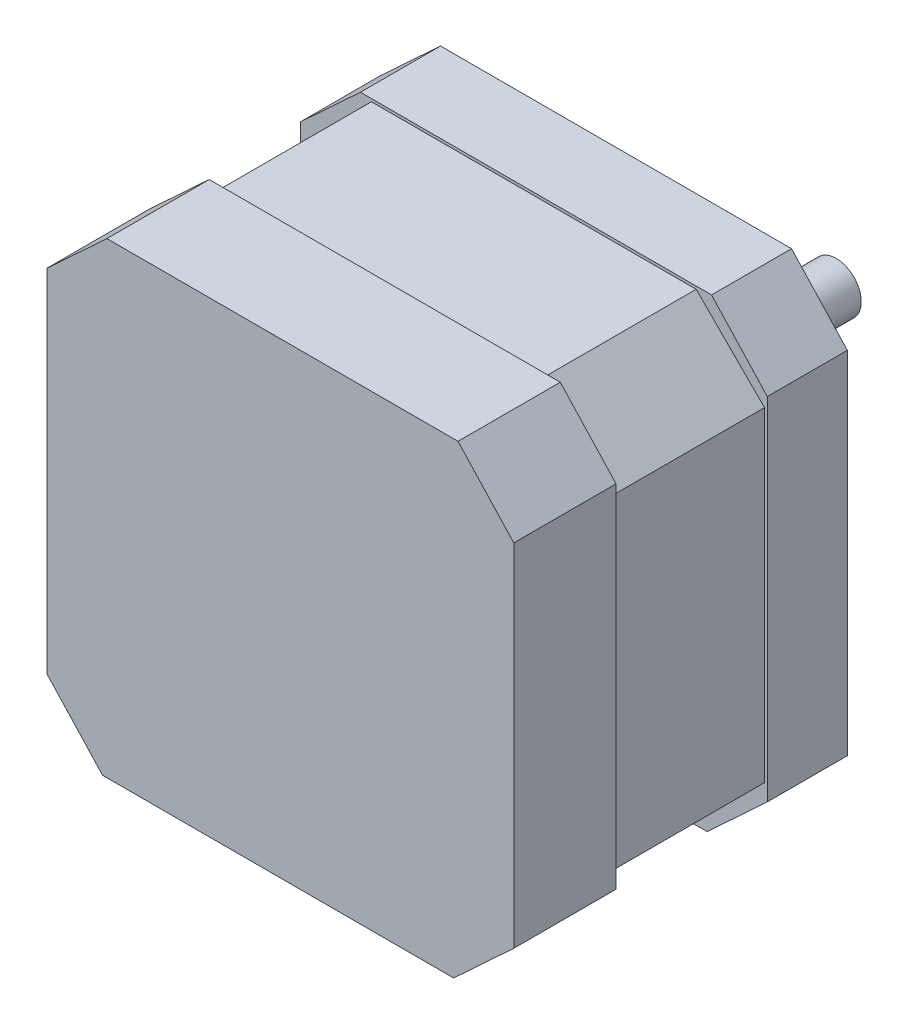
ISO-10303-21;
HEADER;
FILE_DESCRIPTION(('STEP AP214'),'2;1');
FILE_NAME('part.step','',(''),(''),'','','');
FILE_SCHEMA(('AUTOMOTIVE_DESIGN { 1 0 10303 214 1 1 1 1 }'));
ENDSEC;
DATA;
#1=APPLICATION_CONTEXT('core data for automotive mechanical design processes');
#2=APPLICATION_PROTOCOL_DEFINITION('international standard','automotive_design',2000,#1);
#3=PRODUCT_CONTEXT('',#1,'mechanical');
#4=PRODUCT('Part','Part','',(#3));
#5=PRODUCT_RELATED_PRODUCT_CATEGORY('part','',(#4));
#6=PRODUCT_DEFINITION_FORMATION('','',#4);
#7=PRODUCT_DEFINITION_CONTEXT('part definition',#1,'design');
#8=PRODUCT_DEFINITION('design','',#6,#7);
#9=PRODUCT_DEFINITION_SHAPE('','',#8);
#10=(LENGTH_UNIT() NAMED_UNIT(*) SI_UNIT(.MILLI.,.METRE.));
#11=(NAMED_UNIT(*) PLANE_ANGLE_UNIT() SI_UNIT($,.RADIAN.));
#12=(NAMED_UNIT(*) SI_UNIT($,.STERADIAN.) SOLID_ANGLE_UNIT());
#13=UNCERTAINTY_MEASURE_WITH_UNIT(LENGTH_MEASURE(1.E-05),#10,'distance_accuracy_value','');
#14=(GEOMETRIC_REPRESENTATION_CONTEXT(3) GLOBAL_UNCERTAINTY_ASSIGNED_CONTEXT((#13)) GLOBAL_UNIT_ASSIGNED_CONTEXT((#10,
#11,#12)) REPRESENTATION_CONTEXT('',''));
#15=CARTESIAN_POINT('',(0.,0.,0.));
#16=DIRECTION('',(0.,0.,1.));
#17=DIRECTION('',(1.,0.,0.));
#18=AXIS2_PLACEMENT_3D('',#15,#16,#17);
#19=CARTESIAN_POINT('',(21.,0.,30.));
#20=DIRECTION('',(1.,0.,0.));
#21=DIRECTION('',(0.,1.,0.));
#22=AXIS2_PLACEMENT_3D('',#19,#20,#21);
#23=PLANE('',#22);
#24=DIRECTION('',(0.,0.,-1.));
#25=VECTOR('',#24,1.);
#26=CARTESIAN_POINT('',(21.,-15.9841759962391,30.));
#27=LINE('',#26,#25);
#28=CARTESIAN_POINT('',(21.,-15.9841759962391,30.));
#29=VERTEX_POINT('',#28);
#30=CARTESIAN_POINT('',(21.,-15.9841759962391,20.8));
#31=VERTEX_POINT('',#30);
#32=EDGE_CURVE('E380',#29,#31,#27,.T.);
#33=ORIENTED_EDGE('',*,*,#32,.T.);
#34=DIRECTION('',(0.,1.,0.));
#35=VECTOR('',#34,1.);
#36=CARTESIAN_POINT('',(21.,0.,20.8));
#37=LINE('',#36,#35);
#38=CARTESIAN_POINT('',(21.,15.5921718725903,20.8));
#39=VERTEX_POINT('',#38);
#40=EDGE_CURVE('E107',#31,#39,#37,.T.);
#41=ORIENTED_EDGE('',*,*,#40,.T.);
#42=DIRECTION('',(0.,0.,-1.));
#43=VECTOR('',#42,1.);
#44=CARTESIAN_POINT('',(21.,15.5921718725903,30.));
#45=LINE('',#44,#43);
#46=CARTESIAN_POINT('',(21.,15.5921718725903,30.));
#47=VERTEX_POINT('',#46);
#48=EDGE_CURVE('E408',#47,#39,#45,.T.);
#49=ORIENTED_EDGE('',*,*,#48,.F.);
#50=DIRECTION('',(0.,-1.,0.));
#51=VECTOR('',#50,1.);
#52=CARTESIAN_POINT('',(21.,0.,30.));
#53=LINE('',#52,#51);
#54=EDGE_CURVE('E336',#47,#29,#53,.T.);
#55=ORIENTED_EDGE('',*,*,#54,.T.);
#56=EDGE_LOOP('',(#33,#41,#49,#55));
#57=FACE_BOUND('',#56,.T.);
#58=ADVANCED_FACE('F85',(#57),#23,.T.);
#59=CARTESIAN_POINT('',(19.0627004123154,17.6808781736177,30.));
#60=DIRECTION('',(-0.733180785089054,-0.680033775908373,0.));
#61=DIRECTION('',(0.680033775908373,-0.733180785089054,0.));
#62=AXIS2_PLACEMENT_3D('',#59,#60,#61);
#63=PLANE('',#62);
#64=DIRECTION('',(0.680033775908373,-0.733180785089054,0.));
#65=VECTOR('',#64,1.);
#66=CARTESIAN_POINT('',(19.0627004123154,17.6808781736177,20.8));
#67=LINE('',#66,#65);
#68=CARTESIAN_POINT('',(15.9841759962391,21.,20.8));
#69=VERTEX_POINT('',#68);
#70=EDGE_CURVE('E332',#69,#39,#67,.T.);
#71=ORIENTED_EDGE('',*,*,#70,.F.);
#72=DIRECTION('',(0.,0.,-1.));
#73=VECTOR('',#72,1.);
#74=CARTESIAN_POINT('',(15.9841759962391,21.,30.));
#75=LINE('',#74,#73);
#76=CARTESIAN_POINT('',(15.9841759962391,21.,30.));
#77=VERTEX_POINT('',#76);
#78=EDGE_CURVE('E404',#77,#69,#75,.T.);
#79=ORIENTED_EDGE('',*,*,#78,.F.);
#80=DIRECTION('',(-0.680033775908373,0.733180785089054,0.));
#81=VECTOR('',#80,1.);
#82=CARTESIAN_POINT('',(19.0627004123154,17.6808781736177,30.));
#83=LINE('',#82,#81);
#84=EDGE_CURVE('E339',#47,#77,#83,.T.);
#85=ORIENTED_EDGE('',*,*,#84,.F.);
#86=ORIENTED_EDGE('',*,*,#48,.T.);
#87=EDGE_LOOP('',(#71,#79,#85,#86));
#88=FACE_BOUND('',#87,.T.);
#89=ADVANCED_FACE('F480',(#88),#63,.F.);
#90=CARTESIAN_POINT('',(0.,21.,30.));
#91=DIRECTION('',(0.,1.,0.));
#92=DIRECTION('',(0.,0.,1.));
#93=AXIS2_PLACEMENT_3D('',#90,#91,#92);
#94=PLANE('',#93);
#95=ORIENTED_EDGE('',*,*,#78,.T.);
#96=DIRECTION('',(-1.,0.,0.));
#97=VECTOR('',#96,1.);
#98=CARTESIAN_POINT('',(0.,21.,20.8));
#99=LINE('',#98,#97);
#100=CARTESIAN_POINT('',(-15.5921718725903,21.,20.8));
#101=VERTEX_POINT('',#100);
#102=EDGE_CURVE('E329',#69,#101,#99,.T.);
#103=ORIENTED_EDGE('',*,*,#102,.T.);
#104=DIRECTION('',(0.,0.,-1.));
#105=VECTOR('',#104,1.);
#106=CARTESIAN_POINT('',(-15.5921718725903,21.,30.));
#107=LINE('',#106,#105);
#108=CARTESIAN_POINT('',(-15.5921718725903,21.,30.));
#109=VERTEX_POINT('',#108);
#110=EDGE_CURVE('E400',#109,#101,#107,.T.);
#111=ORIENTED_EDGE('',*,*,#110,.F.);
#112=DIRECTION('',(1.,0.,0.));
#113=VECTOR('',#112,1.);
#114=CARTESIAN_POINT('',(0.,21.,30.));
#115=LINE('',#114,#113);
#116=EDGE_CURVE('E342',#109,#77,#115,.T.);
#117=ORIENTED_EDGE('',*,*,#116,.T.);
#118=EDGE_LOOP('',(#95,#103,#111,#117));
#119=FACE_BOUND('',#118,.T.);
#120=ADVANCED_FACE('F486',(#119),#94,.T.);
#121=CARTESIAN_POINT('',(-17.6808781736177,19.0627004123154,30.));
#122=DIRECTION('',(-0.680033775908373,0.733180785089054,0.));
#123=DIRECTION('',(-0.733180785089054,-0.680033775908373,0.));
#124=AXIS2_PLACEMENT_3D('',#121,#122,#123);
#125=PLANE('',#124);
#126=ORIENTED_EDGE('',*,*,#110,.T.);
#127=DIRECTION('',(-0.733180785089054,-0.680033775908373,0.));
#128=VECTOR('',#127,1.);
#129=CARTESIAN_POINT('',(-17.6808781736177,19.0627004123154,20.8));
#130=LINE('',#129,#128);
#131=CARTESIAN_POINT('',(-21.,15.9841759962391,20.8));
#132=VERTEX_POINT('',#131);
#133=EDGE_CURVE('E326',#101,#132,#130,.T.);
#134=ORIENTED_EDGE('',*,*,#133,.T.);
#135=DIRECTION('',(0.,0.,-1.));
#136=VECTOR('',#135,1.);
#137=CARTESIAN_POINT('',(-21.,15.9841759962391,30.));
#138=LINE('',#137,#136);
#139=CARTESIAN_POINT('',(-21.,15.9841759962391,30.));
#140=VERTEX_POINT('',#139);
#141=EDGE_CURVE('E396',#140,#132,#138,.T.);
#142=ORIENTED_EDGE('',*,*,#141,.F.);
#143=DIRECTION('',(0.733180785089054,0.680033775908373,0.));
#144=VECTOR('',#143,1.);
#145=CARTESIAN_POINT('',(-17.6808781736177,19.0627004123154,30.));
#146=LINE('',#145,#144);
#147=EDGE_CURVE('E345',#140,#109,#146,.T.);
#148=ORIENTED_EDGE('',*,*,#147,.T.);
#149=EDGE_LOOP('',(#126,#134,#142,#148));
#150=FACE_BOUND('',#149,.T.);
#151=ADVANCED_FACE('F572',(#150),#125,.T.);
#152=CARTESIAN_POINT('',(-21.,0.,30.));
#153=DIRECTION('',(1.,0.,0.));
#154=DIRECTION('',(0.,1.,0.));
#155=AXIS2_PLACEMENT_3D('',#152,#153,#154);
#156=PLANE('',#155);
#157=DIRECTION('',(0.,1.,0.));
#158=VECTOR('',#157,1.);
#159=CARTESIAN_POINT('',(-21.,0.,20.8));
#160=LINE('',#159,#158);
#161=CARTESIAN_POINT('',(-21.,-15.5921718725903,20.8));
#162=VERTEX_POINT('',#161);
#163=EDGE_CURVE('E324',#162,#132,#160,.T.);
#164=ORIENTED_EDGE('',*,*,#163,.F.);
#165=DIRECTION('',(0.,0.,-1.));
#166=VECTOR('',#165,1.);
#167=CARTESIAN_POINT('',(-21.,-15.5921718725903,30.));
#168=LINE('',#167,#166);
#169=CARTESIAN_POINT('',(-21.,-15.5921718725903,30.));
#170=VERTEX_POINT('',#169);
#171=EDGE_CURVE('E392',#170,#162,#168,.T.);
#172=ORIENTED_EDGE('',*,*,#171,.F.);
#173=DIRECTION('',(0.,-1.,0.));
#174=VECTOR('',#173,1.);
#175=CARTESIAN_POINT('',(-21.,0.,30.));
#176=LINE('',#175,#174);
#177=EDGE_CURVE('E348',#140,#170,#176,.T.);
#178=ORIENTED_EDGE('',*,*,#177,.F.);
#179=ORIENTED_EDGE('',*,*,#141,.T.);
#180=EDGE_LOOP('',(#164,#172,#178,#179));
#181=FACE_BOUND('',#180,.T.);
#182=ADVANCED_FACE('F569',(#181),#156,.F.);
#183=CARTESIAN_POINT('',(-19.0627004123154,-17.6808781736177,30.));
#184=DIRECTION('',(-0.733180785089054,-0.680033775908373,0.));
#185=DIRECTION('',(0.680033775908373,-0.733180785089054,0.));
#186=AXIS2_PLACEMENT_3D('',#183,#184,#185);
#187=PLANE('',#186);
#188=ORIENTED_EDGE('',*,*,#171,.T.);
#189=DIRECTION('',(0.680033775908373,-0.733180785089054,0.));
#190=VECTOR('',#189,1.);
#191=CARTESIAN_POINT('',(-19.0627004123154,-17.6808781736177,20.8));
#192=LINE('',#191,#190);
#193=CARTESIAN_POINT('',(-15.9841759962391,-21.,20.8));
#194=VERTEX_POINT('',#193);
#195=EDGE_CURVE('E321',#162,#194,#192,.T.);
#196=ORIENTED_EDGE('',*,*,#195,.T.);
#197=DIRECTION('',(0.,0.,-1.));
#198=VECTOR('',#197,1.);
#199=CARTESIAN_POINT('',(-15.9841759962391,-21.,30.));
#200=LINE('',#199,#198);
#201=CARTESIAN_POINT('',(-15.9841759962391,-21.,30.));
#202=VERTEX_POINT('',#201);
#203=EDGE_CURVE('E388',#202,#194,#200,.T.);
#204=ORIENTED_EDGE('',*,*,#203,.F.);
#205=DIRECTION('',(-0.680033775908373,0.733180785089054,0.));
#206=VECTOR('',#205,1.);
#207=CARTESIAN_POINT('',(-19.0627004123154,-17.6808781736177,30.));
#208=LINE('',#207,#206);
#209=EDGE_CURVE('E350',#202,#170,#208,.T.);
#210=ORIENTED_EDGE('',*,*,#209,.T.);
#211=EDGE_LOOP('',(#188,#196,#204,#210));
#212=FACE_BOUND('',#211,.T.);
#213=ADVANCED_FACE('F552',(#212),#187,.T.);
#214=CARTESIAN_POINT('',(0.,-21.,30.));
#215=DIRECTION('',(0.,1.,0.));
#216=DIRECTION('',(0.,0.,1.));
#217=AXIS2_PLACEMENT_3D('',#214,#215,#216);
#218=PLANE('',#217);
#219=DIRECTION('',(-1.,0.,0.));
#220=VECTOR('',#219,1.);
#221=CARTESIAN_POINT('',(0.,-21.,20.8));
#222=LINE('',#221,#220);
#223=CARTESIAN_POINT('',(15.5921718725902,-21.,20.8));
#224=VERTEX_POINT('',#223);
#225=EDGE_CURVE('E319',#224,#194,#222,.T.);
#226=ORIENTED_EDGE('',*,*,#225,.F.);
#227=DIRECTION('',(0.,0.,-1.));
#228=VECTOR('',#227,1.);
#229=CARTESIAN_POINT('',(15.5921718725902,-21.,30.));
#230=LINE('',#229,#228);
#231=CARTESIAN_POINT('',(15.5921718725902,-21.,30.));
#232=VERTEX_POINT('',#231);
#233=EDGE_CURVE('E384',#232,#224,#230,.T.);
#234=ORIENTED_EDGE('',*,*,#233,.F.);
#235=DIRECTION('',(1.,0.,0.));
#236=VECTOR('',#235,1.);
#237=CARTESIAN_POINT('',(0.,-21.,30.));
#238=LINE('',#237,#236);
#239=EDGE_CURVE('E353',#202,#232,#238,.T.);
#240=ORIENTED_EDGE('',*,*,#239,.F.);
#241=ORIENTED_EDGE('',*,*,#203,.T.);
#242=EDGE_LOOP('',(#226,#234,#240,#241));
#243=FACE_BOUND('',#242,.T.);
#244=ADVANCED_FACE('F540',(#243),#218,.F.);
#245=CARTESIAN_POINT('',(17.6808781736177,-19.0627004123154,30.));
#246=DIRECTION('',(-0.680033775908373,0.733180785089054,0.));
#247=DIRECTION('',(-0.733180785089054,-0.680033775908373,0.));
#248=AXIS2_PLACEMENT_3D('',#245,#246,#247);
#249=PLANE('',#248);
#250=DIRECTION('',(-0.733180785089054,-0.680033775908373,0.));
#251=VECTOR('',#250,1.);
#252=CARTESIAN_POINT('',(17.6808781736177,-19.0627004123154,20.8));
#253=LINE('',#252,#251);
#254=EDGE_CURVE('E92',#31,#224,#253,.T.);
#255=ORIENTED_EDGE('',*,*,#254,.F.);
#256=ORIENTED_EDGE('',*,*,#32,.F.);
#257=DIRECTION('',(0.733180785089054,0.680033775908373,0.));
#258=VECTOR('',#257,1.);
#259=CARTESIAN_POINT('',(17.6808781736177,-19.0627004123154,30.));
#260=LINE('',#259,#258);
#261=EDGE_CURVE('E355',#232,#29,#260,.T.);
#262=ORIENTED_EDGE('',*,*,#261,.F.);
#263=ORIENTED_EDGE('',*,*,#233,.T.);
#264=EDGE_LOOP('',(#255,#256,#262,#263));
#265=FACE_BOUND('',#264,.T.);
#266=ADVANCED_FACE('F534',(#265),#249,.F.);
#267=CARTESIAN_POINT('',(0.,0.,30.));
#268=DIRECTION('',(0.,0.,1.));
#269=DIRECTION('',(1.,0.,0.));
#270=AXIS2_PLACEMENT_3D('',#267,#268,#269);
#271=PLANE('',#270);
#272=ORIENTED_EDGE('',*,*,#54,.F.);
#273=ORIENTED_EDGE('',*,*,#84,.T.);
#274=ORIENTED_EDGE('',*,*,#116,.F.);
#275=ORIENTED_EDGE('',*,*,#147,.F.);
#276=ORIENTED_EDGE('',*,*,#177,.T.);
#277=ORIENTED_EDGE('',*,*,#209,.F.);
#278=ORIENTED_EDGE('',*,*,#239,.T.);
#279=ORIENTED_EDGE('',*,*,#261,.T.);
#280=EDGE_LOOP('',(#272,#273,#274,#275,#276,#277,#278,#279));
#281=FACE_BOUND('',#280,.T.);
#282=ADVANCED_FACE('F544',(#281),#271,.T.);
#283=CARTESIAN_POINT('',(0.,0.,20.8));
#284=DIRECTION('',(0.,0.,-1.));
#285=DIRECTION('',(-1.,0.,0.));
#286=AXIS2_PLACEMENT_3D('',#283,#284,#285);
#287=PLANE('',#286);
#288=ORIENTED_EDGE('',*,*,#254,.T.);
#289=ORIENTED_EDGE('',*,*,#225,.T.);
#290=ORIENTED_EDGE('',*,*,#195,.F.);
#291=ORIENTED_EDGE('',*,*,#163,.T.);
#292=ORIENTED_EDGE('',*,*,#133,.F.);
#293=ORIENTED_EDGE('',*,*,#102,.F.);
#294=ORIENTED_EDGE('',*,*,#70,.T.);
#295=ORIENTED_EDGE('',*,*,#40,.F.);
#296=EDGE_LOOP('',(#288,#289,#290,#291,#292,#293,#294,#295));
#297=FACE_BOUND('',#296,.T.);
#298=DIRECTION('',(-0.707106781186548,0.707106781186547,0.));
#299=VECTOR('',#298,1.);
#300=CARTESIAN_POINT('',(17.6776695296637,17.6776695296637,20.8));
#301=LINE('',#300,#299);
#302=CARTESIAN_POINT('',(20.75,14.6053390593274,20.8));
#303=VERTEX_POINT('',#302);
#304=CARTESIAN_POINT('',(14.6053390593274,20.75,20.8));
#305=VERTEX_POINT('',#304);
#306=EDGE_CURVE('E249',#303,#305,#301,.T.);
#307=ORIENTED_EDGE('',*,*,#306,.T.);
#308=DIRECTION('',(1.,0.,0.));
#309=VECTOR('',#308,1.);
#310=CARTESIAN_POINT('',(0.,20.75,20.8));
#311=LINE('',#310,#309);
#312=CARTESIAN_POINT('',(-14.6053390593274,20.75,20.8));
#313=VERTEX_POINT('',#312);
#314=EDGE_CURVE('E263',#313,#305,#311,.T.);
#315=ORIENTED_EDGE('',*,*,#314,.F.);
#316=DIRECTION('',(0.707106781186547,0.707106781186548,0.));
#317=VECTOR('',#316,1.);
#318=CARTESIAN_POINT('',(-17.6776695296637,17.6776695296637,20.8));
#319=LINE('',#318,#317);
#320=CARTESIAN_POINT('',(-20.75,14.6053390593274,20.8));
#321=VERTEX_POINT('',#320);
#322=EDGE_CURVE('E271',#321,#313,#319,.T.);
#323=ORIENTED_EDGE('',*,*,#322,.F.);
#324=DIRECTION('',(0.,1.,0.));
#325=VECTOR('',#324,1.);
#326=CARTESIAN_POINT('',(-20.75,0.,20.8));
#327=LINE('',#326,#325);
#328=CARTESIAN_POINT('',(-20.75,-14.6053390593274,20.8));
#329=VERTEX_POINT('',#328);
#330=EDGE_CURVE('E273',#329,#321,#327,.T.);
#331=ORIENTED_EDGE('',*,*,#330,.F.);
#332=DIRECTION('',(-0.707106781186547,0.707106781186548,0.));
#333=VECTOR('',#332,1.);
#334=CARTESIAN_POINT('',(-17.6776695296637,-17.6776695296637,20.8));
#335=LINE('',#334,#333);
#336=CARTESIAN_POINT('',(-14.6053390593274,-20.75,20.8));
#337=VERTEX_POINT('',#336);
#338=EDGE_CURVE('E279',#337,#329,#335,.T.);
#339=ORIENTED_EDGE('',*,*,#338,.F.);
#340=DIRECTION('',(1.,0.,0.));
#341=VECTOR('',#340,1.);
#342=CARTESIAN_POINT('',(0.,-20.75,20.8));
#343=LINE('',#342,#341);
#344=CARTESIAN_POINT('',(14.6053390593274,-20.75,20.8));
#345=VERTEX_POINT('',#344);
#346=EDGE_CURVE('E282',#337,#345,#343,.T.);
#347=ORIENTED_EDGE('',*,*,#346,.T.);
#348=DIRECTION('',(0.707106781186547,0.707106781186548,0.));
#349=VECTOR('',#348,1.);
#350=CARTESIAN_POINT('',(17.6776695296637,-17.6776695296637,20.8));
#351=LINE('',#350,#349);
#352=CARTESIAN_POINT('',(20.75,-14.6053390593274,20.8));
#353=VERTEX_POINT('',#352);
#354=EDGE_CURVE('E285',#345,#353,#351,.T.);
#355=ORIENTED_EDGE('',*,*,#354,.T.);
#356=DIRECTION('',(0.,1.,0.));
#357=VECTOR('',#356,1.);
#358=CARTESIAN_POINT('',(20.75,0.,20.8));
#359=LINE('',#358,#357);
#360=EDGE_CURVE('E267',#353,#303,#359,.T.);
#361=ORIENTED_EDGE('',*,*,#360,.T.);
#362=EDGE_LOOP('',(#307,#315,#323,#331,#339,#347,#355,#361));
#363=FACE_BOUND('',#362,.T.);
#364=ADVANCED_FACE('F261',(#297,#363),#287,.T.);
#365=CARTESIAN_POINT('',(17.6776695296637,17.6776695296637,-86.9741340859454));
#366=DIRECTION('',(0.707106781186547,0.707106781186548,0.));
#367=DIRECTION('',(-0.707106781186548,0.707106781186547,0.));
#368=AXIS2_PLACEMENT_3D('',#365,#366,#367);
#369=PLANE('',#368);
#370=DIRECTION('',(0.,0.,1.));
#371=VECTOR('',#370,1.);
#372=CARTESIAN_POINT('',(14.6053390593274,20.75,-86.9741340859454));
#373=LINE('',#372,#371);
#374=CARTESIAN_POINT('',(14.6053390593274,20.75,7.2));
#375=VERTEX_POINT('',#374);
#376=EDGE_CURVE('E245',#375,#305,#373,.T.);
#377=ORIENTED_EDGE('',*,*,#376,.T.);
#378=ORIENTED_EDGE('',*,*,#306,.F.);
#379=DIRECTION('',(0.,0.,1.));
#380=VECTOR('',#379,1.);
#381=CARTESIAN_POINT('',(20.75,14.6053390593274,-86.9741340859454));
#382=LINE('',#381,#380);
#383=CARTESIAN_POINT('',(20.75,14.6053390593274,7.2));
#384=VERTEX_POINT('',#383);
#385=EDGE_CURVE('E256',#384,#303,#382,.T.);
#386=ORIENTED_EDGE('',*,*,#385,.F.);
#387=DIRECTION('',(0.707106781186548,-0.707106781186547,0.));
#388=VECTOR('',#387,1.);
#389=CARTESIAN_POINT('',(17.6776695296637,17.6776695296637,7.2));
#390=LINE('',#389,#388);
#391=EDGE_CURVE('E251',#375,#384,#390,.T.);
#392=ORIENTED_EDGE('',*,*,#391,.F.);
#393=EDGE_LOOP('',(#377,#378,#386,#392));
#394=FACE_BOUND('',#393,.T.);
#395=ADVANCED_FACE('F247',(#394),#369,.T.);
#396=CARTESIAN_POINT('',(0.,20.75,-86.9741340859454));
#397=DIRECTION('',(0.,-1.,0.));
#398=DIRECTION('',(0.,0.,-1.));
#399=AXIS2_PLACEMENT_3D('',#396,#397,#398);
#400=PLANE('',#399);
#401=DIRECTION('',(-1.,0.,0.));
#402=VECTOR('',#401,1.);
#403=CARTESIAN_POINT('',(0.,20.75,7.2));
#404=LINE('',#403,#402);
#405=CARTESIAN_POINT('',(-14.6053390593274,20.75,7.2));
#406=VERTEX_POINT('',#405);
#407=EDGE_CURVE('E303',#375,#406,#404,.T.);
#408=ORIENTED_EDGE('',*,*,#407,.T.);
#409=DIRECTION('',(0.,0.,1.));
#410=VECTOR('',#409,1.);
#411=CARTESIAN_POINT('',(-14.6053390593274,20.75,-86.9741340859454));
#412=LINE('',#411,#410);
#413=EDGE_CURVE('E255',#406,#313,#412,.T.);
#414=ORIENTED_EDGE('',*,*,#413,.T.);
#415=ORIENTED_EDGE('',*,*,#314,.T.);
#416=ORIENTED_EDGE('',*,*,#376,.F.);
#417=EDGE_LOOP('',(#408,#414,#415,#416));
#418=FACE_BOUND('',#417,.T.);
#419=ADVANCED_FACE('F269',(#418),#400,.F.);
#420=CARTESIAN_POINT('',(-17.6776695296637,17.6776695296637,-86.9741340859454));
#421=DIRECTION('',(0.707106781186548,-0.707106781186547,0.));
#422=DIRECTION('',(0.707106781186547,0.707106781186548,0.));
#423=AXIS2_PLACEMENT_3D('',#420,#421,#422);
#424=PLANE('',#423);
#425=DIRECTION('',(-0.707106781186547,-0.707106781186548,0.));
#426=VECTOR('',#425,1.);
#427=CARTESIAN_POINT('',(-17.6776695296637,17.6776695296637,7.2));
#428=LINE('',#427,#426);
#429=CARTESIAN_POINT('',(-20.75,14.6053390593274,7.2));
#430=VERTEX_POINT('',#429);
#431=EDGE_CURVE('E432',#406,#430,#428,.T.);
#432=ORIENTED_EDGE('',*,*,#431,.T.);
#433=DIRECTION('',(0.,0.,1.));
#434=VECTOR('',#433,1.);
#435=CARTESIAN_POINT('',(-20.75,14.6053390593274,-86.9741340859454));
#436=LINE('',#435,#434);
#437=EDGE_CURVE('E295',#430,#321,#436,.T.);
#438=ORIENTED_EDGE('',*,*,#437,.T.);
#439=ORIENTED_EDGE('',*,*,#322,.T.);
#440=ORIENTED_EDGE('',*,*,#413,.F.);
#441=EDGE_LOOP('',(#432,#438,#439,#440));
#442=FACE_BOUND('',#441,.T.);
#443=ADVANCED_FACE('F470',(#442),#424,.F.);
#444=CARTESIAN_POINT('',(-20.75,0.,-86.9741340859454));
#445=DIRECTION('',(1.,0.,0.));
#446=DIRECTION('',(0.,0.,-1.));
#447=AXIS2_PLACEMENT_3D('',#444,#445,#446);
#448=PLANE('',#447);
#449=DIRECTION('',(0.,-1.,0.));
#450=VECTOR('',#449,1.);
#451=CARTESIAN_POINT('',(-20.75,0.,7.2));
#452=LINE('',#451,#450);
#453=CARTESIAN_POINT('',(-20.75,-14.6053390593274,7.2));
#454=VERTEX_POINT('',#453);
#455=EDGE_CURVE('E434',#430,#454,#452,.T.);
#456=ORIENTED_EDGE('',*,*,#455,.T.);
#457=DIRECTION('',(0.,0.,1.));
#458=VECTOR('',#457,1.);
#459=CARTESIAN_POINT('',(-20.75,-14.6053390593274,-86.9741340859454));
#460=LINE('',#459,#458);
#461=EDGE_CURVE('E293',#454,#329,#460,.T.);
#462=ORIENTED_EDGE('',*,*,#461,.T.);
#463=ORIENTED_EDGE('',*,*,#330,.T.);
#464=ORIENTED_EDGE('',*,*,#437,.F.);
#465=EDGE_LOOP('',(#456,#462,#463,#464));
#466=FACE_BOUND('',#465,.T.);
#467=ADVANCED_FACE('F467',(#466),#448,.F.);
#468=CARTESIAN_POINT('',(-17.6776695296637,-17.6776695296637,-86.9741340859454));
#469=DIRECTION('',(0.707106781186548,0.707106781186548,0.));
#470=DIRECTION('',(-0.707106781186547,0.707106781186548,0.));
#471=AXIS2_PLACEMENT_3D('',#468,#469,#470);
#472=PLANE('',#471);
#473=DIRECTION('',(0.707106781186547,-0.707106781186548,0.));
#474=VECTOR('',#473,1.);
#475=CARTESIAN_POINT('',(-17.6776695296637,-17.6776695296637,7.2));
#476=LINE('',#475,#474);
#477=CARTESIAN_POINT('',(-14.6053390593274,-20.75,7.2));
#478=VERTEX_POINT('',#477);
#479=EDGE_CURVE('E436',#454,#478,#476,.T.);
#480=ORIENTED_EDGE('',*,*,#479,.T.);
#481=DIRECTION('',(0.,0.,1.));
#482=VECTOR('',#481,1.);
#483=CARTESIAN_POINT('',(-14.6053390593274,-20.75,-86.9741340859454));
#484=LINE('',#483,#482);
#485=EDGE_CURVE('E291',#478,#337,#484,.T.);
#486=ORIENTED_EDGE('',*,*,#485,.T.);
#487=ORIENTED_EDGE('',*,*,#338,.T.);
#488=ORIENTED_EDGE('',*,*,#461,.F.);
#489=EDGE_LOOP('',(#480,#486,#487,#488));
#490=FACE_BOUND('',#489,.T.);
#491=ADVANCED_FACE('F465',(#490),#472,.F.);
#492=CARTESIAN_POINT('',(0.,-20.75,-86.9741340859454));
#493=DIRECTION('',(0.,-1.,0.));
#494=DIRECTION('',(0.,0.,-1.));
#495=AXIS2_PLACEMENT_3D('',#492,#493,#494);
#496=PLANE('',#495);
#497=DIRECTION('',(0.,0.,1.));
#498=VECTOR('',#497,1.);
#499=CARTESIAN_POINT('',(14.6053390593274,-20.75,-86.9741340859454));
#500=LINE('',#499,#498);
#501=CARTESIAN_POINT('',(14.6053390593274,-20.75,7.2));
#502=VERTEX_POINT('',#501);
#503=EDGE_CURVE('E289',#502,#345,#500,.T.);
#504=ORIENTED_EDGE('',*,*,#503,.T.);
#505=ORIENTED_EDGE('',*,*,#346,.F.);
#506=ORIENTED_EDGE('',*,*,#485,.F.);
#507=DIRECTION('',(-1.,0.,0.));
#508=VECTOR('',#507,1.);
#509=CARTESIAN_POINT('',(0.,-20.75,7.2));
#510=LINE('',#509,#508);
#511=EDGE_CURVE('E438',#502,#478,#510,.T.);
#512=ORIENTED_EDGE('',*,*,#511,.F.);
#513=EDGE_LOOP('',(#504,#505,#506,#512));
#514=FACE_BOUND('',#513,.T.);
#515=ADVANCED_FACE('F459',(#514),#496,.T.);
#516=CARTESIAN_POINT('',(17.6776695296637,-17.6776695296637,-86.9741340859454));
#517=DIRECTION('',(0.707106781186548,-0.707106781186548,0.));
#518=DIRECTION('',(0.707106781186547,0.707106781186548,0.));
#519=AXIS2_PLACEMENT_3D('',#516,#517,#518);
#520=PLANE('',#519);
#521=DIRECTION('',(0.,0.,1.));
#522=VECTOR('',#521,1.);
#523=CARTESIAN_POINT('',(20.75,-14.6053390593274,-86.9741340859454));
#524=LINE('',#523,#522);
#525=CARTESIAN_POINT('',(20.75,-14.6053390593274,7.2));
#526=VERTEX_POINT('',#525);
#527=EDGE_CURVE('E287',#526,#353,#524,.T.);
#528=ORIENTED_EDGE('',*,*,#527,.T.);
#529=ORIENTED_EDGE('',*,*,#354,.F.);
#530=ORIENTED_EDGE('',*,*,#503,.F.);
#531=DIRECTION('',(-0.707106781186547,-0.707106781186548,0.));
#532=VECTOR('',#531,1.);
#533=CARTESIAN_POINT('',(17.6776695296637,-17.6776695296637,7.2));
#534=LINE('',#533,#532);
#535=EDGE_CURVE('E441',#526,#502,#534,.T.);
#536=ORIENTED_EDGE('',*,*,#535,.F.);
#537=EDGE_LOOP('',(#528,#529,#530,#536));
#538=FACE_BOUND('',#537,.T.);
#539=ADVANCED_FACE('F452',(#538),#520,.T.);
#540=CARTESIAN_POINT('',(20.75,0.,-86.9741340859454));
#541=DIRECTION('',(1.,0.,0.));
#542=DIRECTION('',(0.,0.,-1.));
#543=AXIS2_PLACEMENT_3D('',#540,#541,#542);
#544=PLANE('',#543);
#545=ORIENTED_EDGE('',*,*,#385,.T.);
#546=ORIENTED_EDGE('',*,*,#360,.F.);
#547=ORIENTED_EDGE('',*,*,#527,.F.);
#548=DIRECTION('',(0.,-1.,0.));
#549=VECTOR('',#548,1.);
#550=CARTESIAN_POINT('',(20.75,0.,7.2));
#551=LINE('',#550,#549);
#552=EDGE_CURVE('E300',#384,#526,#551,.T.);
#553=ORIENTED_EDGE('',*,*,#552,.F.);
#554=EDGE_LOOP('',(#545,#546,#547,#553));
#555=FACE_BOUND('',#554,.T.);
#556=ADVANCED_FACE('F449',(#555),#544,.T.);
#557=CARTESIAN_POINT('',(0.,0.,7.2));
#558=DIRECTION('',(0.,0.,1.));
#559=DIRECTION('',(1.,0.,0.));
#560=AXIS2_PLACEMENT_3D('',#557,#558,#559);
#561=PLANE('',#560);
#562=DIRECTION('',(-0.680033775908373,0.733180785089054,0.));
#563=VECTOR('',#562,1.);
#564=CARTESIAN_POINT('',(19.0627004123154,17.6808781736177,7.2));
#565=LINE('',#564,#563);
#566=CARTESIAN_POINT('',(21.,15.5921718725903,7.2));
#567=VERTEX_POINT('',#566);
#568=CARTESIAN_POINT('',(15.9841759962391,21.,7.2));
#569=VERTEX_POINT('',#568);
#570=EDGE_CURVE('E314',#567,#569,#565,.T.);
#571=ORIENTED_EDGE('',*,*,#570,.T.);
#572=DIRECTION('',(1.,0.,0.));
#573=VECTOR('',#572,1.);
#574=CARTESIAN_POINT('',(0.,21.,7.2));
#575=LINE('',#574,#573);
#576=CARTESIAN_POINT('',(-15.5921718725903,21.,7.2));
#577=VERTEX_POINT('',#576);
#578=EDGE_CURVE('E311',#577,#569,#575,.T.);
#579=ORIENTED_EDGE('',*,*,#578,.F.);
#580=DIRECTION('',(0.733180785089054,0.680033775908373,0.));
#581=VECTOR('',#580,1.);
#582=CARTESIAN_POINT('',(-17.6808781736177,19.0627004123154,7.2));
#583=LINE('',#582,#581);
#584=CARTESIAN_POINT('',(-21.,15.9841759962391,7.2));
#585=VERTEX_POINT('',#584);
#586=EDGE_CURVE('E308',#585,#577,#583,.T.);
#587=ORIENTED_EDGE('',*,*,#586,.F.);
#588=DIRECTION('',(0.,-1.,0.));
#589=VECTOR('',#588,1.);
#590=CARTESIAN_POINT('',(-21.,0.,7.2));
#591=LINE('',#590,#589);
#592=CARTESIAN_POINT('',(-21.,-15.5921718725903,7.2));
#593=VERTEX_POINT('',#592);
#594=EDGE_CURVE('E306',#585,#593,#591,.T.);
#595=ORIENTED_EDGE('',*,*,#594,.T.);
#596=DIRECTION('',(-0.680033775908373,0.733180785089054,0.));
#597=VECTOR('',#596,1.);
#598=CARTESIAN_POINT('',(-19.0627004123154,-17.6808781736177,7.2));
#599=LINE('',#598,#597);
#600=CARTESIAN_POINT('',(-15.9841759962391,-21.,7.2));
#601=VERTEX_POINT('',#600);
#602=EDGE_CURVE('E302',#601,#593,#599,.T.);
#603=ORIENTED_EDGE('',*,*,#602,.F.);
#604=DIRECTION('',(1.,0.,0.));
#605=VECTOR('',#604,1.);
#606=CARTESIAN_POINT('',(0.,-21.,7.2));
#607=LINE('',#606,#605);
#608=CARTESIAN_POINT('',(15.5921718725902,-21.,7.2));
#609=VERTEX_POINT('',#608);
#610=EDGE_CURVE('E99',#601,#609,#607,.T.);
#611=ORIENTED_EDGE('',*,*,#610,.T.);
#612=DIRECTION('',(0.733180785089054,0.680033775908373,0.));
#613=VECTOR('',#612,1.);
#614=CARTESIAN_POINT('',(17.6808781736177,-19.0627004123154,7.2));
#615=LINE('',#614,#613);
#616=CARTESIAN_POINT('',(21.,-15.9841759962391,7.2));
#617=VERTEX_POINT('',#616);
#618=EDGE_CURVE('E411',#609,#617,#615,.T.);
#619=ORIENTED_EDGE('',*,*,#618,.T.);
#620=DIRECTION('',(0.,-1.,0.));
#621=VECTOR('',#620,1.);
#622=CARTESIAN_POINT('',(21.,0.,7.2));
#623=LINE('',#622,#621);
#624=EDGE_CURVE('E316',#567,#617,#623,.T.);
#625=ORIENTED_EDGE('',*,*,#624,.F.);
#626=EDGE_LOOP('',(#571,#579,#587,#595,#603,#611,#619,#625));
#627=FACE_BOUND('',#626,.T.);
#628=ORIENTED_EDGE('',*,*,#391,.T.);
#629=ORIENTED_EDGE('',*,*,#552,.T.);
#630=ORIENTED_EDGE('',*,*,#535,.T.);
#631=ORIENTED_EDGE('',*,*,#511,.T.);
#632=ORIENTED_EDGE('',*,*,#479,.F.);
#633=ORIENTED_EDGE('',*,*,#455,.F.);
#634=ORIENTED_EDGE('',*,*,#431,.F.);
#635=ORIENTED_EDGE('',*,*,#407,.F.);
#636=EDGE_LOOP('',(#628,#629,#630,#631,#632,#633,#634,#635));
#637=FACE_BOUND('',#636,.T.);
#638=ADVANCED_FACE('F446',(#627,#637),#561,.T.);
#639=CARTESIAN_POINT('',(0.,0.,0.));
#640=DIRECTION('',(0.,0.,1.));
#641=DIRECTION('',(1.,0.,0.));
#642=AXIS2_PLACEMENT_3D('',#639,#640,#641);
#643=PLANE('',#642);
#644=CARTESIAN_POINT('',(15.5,-15.5,0.));
#645=DIRECTION('',(0.,0.,-1.));
#646=DIRECTION('',(-1.,0.,0.));
#647=AXIS2_PLACEMENT_3D('',#644,#645,#646);
#648=CIRCLE('',#647,1.5);
#649=CARTESIAN_POINT('',(14.,-15.5,0.));
#650=VERTEX_POINT('',#649);
#651=EDGE_CURVE('E876',#650,#650,#648,.T.);
#652=ORIENTED_EDGE('',*,*,#651,.F.);
#653=EDGE_LOOP('',(#652));
#654=FACE_BOUND('',#653,.T.);
#655=CARTESIAN_POINT('',(15.5,15.5,0.));
#656=DIRECTION('',(0.,0.,-1.));
#657=DIRECTION('',(-1.,0.,0.));
#658=AXIS2_PLACEMENT_3D('',#655,#656,#657);
#659=CIRCLE('',#658,1.5);
#660=CARTESIAN_POINT('',(14.,15.5,0.));
#661=VERTEX_POINT('',#660);
#662=EDGE_CURVE('E885',#661,#661,#659,.T.);
#663=ORIENTED_EDGE('',*,*,#662,.F.);
#664=EDGE_LOOP('',(#663));
#665=FACE_BOUND('',#664,.T.);
#666=CARTESIAN_POINT('',(-15.5,15.5,0.));
#667=DIRECTION('',(0.,0.,-1.));
#668=DIRECTION('',(-1.,0.,0.));
#669=AXIS2_PLACEMENT_3D('',#666,#667,#668);
#670=CIRCLE('',#669,1.5);
#671=CARTESIAN_POINT('',(-17.,15.5,0.));
#672=VERTEX_POINT('',#671);
#673=EDGE_CURVE('E891',#672,#672,#670,.T.);
#674=ORIENTED_EDGE('',*,*,#673,.F.);
#675=EDGE_LOOP('',(#674));
#676=FACE_BOUND('',#675,.T.);
#677=CARTESIAN_POINT('',(-15.5,-15.5,0.));
#678=DIRECTION('',(0.,0.,-1.));
#679=DIRECTION('',(-1.,0.,0.));
#680=AXIS2_PLACEMENT_3D('',#677,#678,#679);
#681=CIRCLE('',#680,1.5);
#682=CARTESIAN_POINT('',(-17.,-15.5,0.));
#683=VERTEX_POINT('',#682);
#684=EDGE_CURVE('E427',#683,#683,#681,.T.);
#685=ORIENTED_EDGE('',*,*,#684,.F.);
#686=EDGE_LOOP('',(#685));
#687=FACE_BOUND('',#686,.T.);
#688=CARTESIAN_POINT('',(0.,0.,0.));
#689=DIRECTION('',(0.,0.,1.));
#690=DIRECTION('',(1.,0.,0.));
#691=AXIS2_PLACEMENT_3D('',#688,#689,#690);
#692=CIRCLE('',#691,10.);
#693=CARTESIAN_POINT('',(10.,0.,0.));
#694=VERTEX_POINT('',#693);
#695=EDGE_CURVE('E13',#694,#694,#692,.F.);
#696=ORIENTED_EDGE('',*,*,#695,.F.);
#697=EDGE_LOOP('',(#696));
#698=FACE_BOUND('',#697,.T.);
#699=DIRECTION('',(0.,-1.,0.));
#700=VECTOR('',#699,1.);
#701=CARTESIAN_POINT('',(21.,0.,0.));
#702=LINE('',#701,#700);
#703=CARTESIAN_POINT('',(21.,15.5921718725903,0.));
#704=VERTEX_POINT('',#703);
#705=CARTESIAN_POINT('',(21.,-15.9841759962391,0.));
#706=VERTEX_POINT('',#705);
#707=EDGE_CURVE('E335',#704,#706,#702,.T.);
#708=ORIENTED_EDGE('',*,*,#707,.T.);
#709=DIRECTION('',(0.733180785089054,0.680033775908373,0.));
#710=VECTOR('',#709,1.);
#711=CARTESIAN_POINT('',(17.6808781736177,-19.0627004123154,0.));
#712=LINE('',#711,#710);
#713=CARTESIAN_POINT('',(15.5921718725902,-21.,0.));
#714=VERTEX_POINT('',#713);
#715=EDGE_CURVE('E340',#714,#706,#712,.T.);
#716=ORIENTED_EDGE('',*,*,#715,.F.);
#717=DIRECTION('',(1.,0.,0.));
#718=VECTOR('',#717,1.);
#719=CARTESIAN_POINT('',(0.,-21.,0.));
#720=LINE('',#719,#718);
#721=CARTESIAN_POINT('',(-15.9841759962391,-21.,0.));
#722=VERTEX_POINT('',#721);
#723=EDGE_CURVE('E375',#722,#714,#720,.T.);
#724=ORIENTED_EDGE('',*,*,#723,.F.);
#725=DIRECTION('',(-0.680033775908373,0.733180785089054,0.));
#726=VECTOR('',#725,1.);
#727=CARTESIAN_POINT('',(-19.0627004123154,-17.6808781736177,0.));
#728=LINE('',#727,#726);
#729=CARTESIAN_POINT('',(-21.,-15.5921718725903,0.));
#730=VERTEX_POINT('',#729);
#731=EDGE_CURVE('E372',#722,#730,#728,.T.);
#732=ORIENTED_EDGE('',*,*,#731,.T.);
#733=DIRECTION('',(0.,-1.,0.));
#734=VECTOR('',#733,1.);
#735=CARTESIAN_POINT('',(-21.,0.,0.));
#736=LINE('',#735,#734);
#737=CARTESIAN_POINT('',(-21.,15.9841759962391,0.));
#738=VERTEX_POINT('',#737);
#739=EDGE_CURVE('E369',#738,#730,#736,.T.);
#740=ORIENTED_EDGE('',*,*,#739,.F.);
#741=DIRECTION('',(0.733180785089054,0.680033775908373,0.));
#742=VECTOR('',#741,1.);
#743=CARTESIAN_POINT('',(-17.6808781736177,19.0627004123154,0.));
#744=LINE('',#743,#742);
#745=CARTESIAN_POINT('',(-15.5921718725903,21.,0.));
#746=VERTEX_POINT('',#745);
#747=EDGE_CURVE('E366',#738,#746,#744,.T.);
#748=ORIENTED_EDGE('',*,*,#747,.T.);
#749=DIRECTION('',(1.,0.,0.));
#750=VECTOR('',#749,1.);
#751=CARTESIAN_POINT('',(0.,21.,0.));
#752=LINE('',#751,#750);
#753=CARTESIAN_POINT('',(15.9841759962391,21.,0.));
#754=VERTEX_POINT('',#753);
#755=EDGE_CURVE('E363',#746,#754,#752,.T.);
#756=ORIENTED_EDGE('',*,*,#755,.T.);
#757=DIRECTION('',(-0.680033775908373,0.733180785089054,0.));
#758=VECTOR('',#757,1.);
#759=CARTESIAN_POINT('',(19.0627004123154,17.6808781736177,0.));
#760=LINE('',#759,#758);
#761=EDGE_CURVE('E360',#704,#754,#760,.T.);
#762=ORIENTED_EDGE('',*,*,#761,.F.);
#763=EDGE_LOOP('',(#708,#716,#724,#732,#740,#748,#756,#762));
#764=FACE_BOUND('',#763,.T.);
#765=ADVANCED_FACE('F508',(#654,#665,#676,#687,#698,#764),#643,.F.);
#766=ORIENTED_EDGE('',*,*,#618,.F.);
#767=EDGE_CURVE('E383',#609,#714,#230,.T.);
#768=ORIENTED_EDGE('',*,*,#767,.T.);
#769=ORIENTED_EDGE('',*,*,#715,.T.);
#770=EDGE_CURVE('E357',#617,#706,#27,.T.);
#771=ORIENTED_EDGE('',*,*,#770,.F.);
#772=EDGE_LOOP('',(#766,#768,#769,#771));
#773=FACE_BOUND('',#772,.T.);
#774=ADVANCED_FACE('F531',(#773),#249,.F.);
#775=ORIENTED_EDGE('',*,*,#610,.F.);
#776=EDGE_CURVE('E387',#601,#722,#200,.T.);
#777=ORIENTED_EDGE('',*,*,#776,.T.);
#778=ORIENTED_EDGE('',*,*,#723,.T.);
#779=ORIENTED_EDGE('',*,*,#767,.F.);
#780=EDGE_LOOP('',(#775,#777,#778,#779));
#781=FACE_BOUND('',#780,.T.);
#782=ADVANCED_FACE('F529',(#781),#218,.F.);
#783=ORIENTED_EDGE('',*,*,#776,.F.);
#784=ORIENTED_EDGE('',*,*,#602,.T.);
#785=EDGE_CURVE('E391',#593,#730,#168,.T.);
#786=ORIENTED_EDGE('',*,*,#785,.T.);
#787=ORIENTED_EDGE('',*,*,#731,.F.);
#788=EDGE_LOOP('',(#783,#784,#786,#787));
#789=FACE_BOUND('',#788,.T.);
#790=ADVANCED_FACE('F526',(#789),#187,.T.);
#791=ORIENTED_EDGE('',*,*,#594,.F.);
#792=EDGE_CURVE('E395',#585,#738,#138,.T.);
#793=ORIENTED_EDGE('',*,*,#792,.T.);
#794=ORIENTED_EDGE('',*,*,#739,.T.);
#795=ORIENTED_EDGE('',*,*,#785,.F.);
#796=EDGE_LOOP('',(#791,#793,#794,#795));
#797=FACE_BOUND('',#796,.T.);
#798=ADVANCED_FACE('F520',(#797),#156,.F.);
#799=ORIENTED_EDGE('',*,*,#792,.F.);
#800=ORIENTED_EDGE('',*,*,#586,.T.);
#801=EDGE_CURVE('E399',#577,#746,#107,.T.);
#802=ORIENTED_EDGE('',*,*,#801,.T.);
#803=ORIENTED_EDGE('',*,*,#747,.F.);
#804=EDGE_LOOP('',(#799,#800,#802,#803));
#805=FACE_BOUND('',#804,.T.);
#806=ADVANCED_FACE('F518',(#805),#125,.T.);
#807=ORIENTED_EDGE('',*,*,#801,.F.);
#808=ORIENTED_EDGE('',*,*,#578,.T.);
#809=EDGE_CURVE('E403',#569,#754,#75,.T.);
#810=ORIENTED_EDGE('',*,*,#809,.T.);
#811=ORIENTED_EDGE('',*,*,#755,.F.);
#812=EDGE_LOOP('',(#807,#808,#810,#811));
#813=FACE_BOUND('',#812,.T.);
#814=ADVANCED_FACE('F499',(#813),#94,.T.);
#815=ORIENTED_EDGE('',*,*,#570,.F.);
#816=EDGE_CURVE('E407',#567,#704,#45,.T.);
#817=ORIENTED_EDGE('',*,*,#816,.T.);
#818=ORIENTED_EDGE('',*,*,#761,.T.);
#819=ORIENTED_EDGE('',*,*,#809,.F.);
#820=EDGE_LOOP('',(#815,#817,#818,#819));
#821=FACE_BOUND('',#820,.T.);
#822=ADVANCED_FACE('F488',(#821),#63,.F.);
#823=ORIENTED_EDGE('',*,*,#816,.F.);
#824=ORIENTED_EDGE('',*,*,#624,.T.);
#825=ORIENTED_EDGE('',*,*,#770,.T.);
#826=ORIENTED_EDGE('',*,*,#707,.F.);
#827=EDGE_LOOP('',(#823,#824,#825,#826));
#828=FACE_BOUND('',#827,.T.);
#829=ADVANCED_FACE('F482',(#828),#23,.T.);
#830=CARTESIAN_POINT('',(0.,0.,-2.));
#831=DIRECTION('',(0.,0.,1.));
#832=DIRECTION('',(1.,0.,0.));
#833=AXIS2_PLACEMENT_3D('',#830,#831,#832);
#834=CYLINDRICAL_SURFACE('',#833,10.);
#835=CARTESIAN_POINT('',(0.,0.,-2.));
#836=DIRECTION('',(0.,0.,-1.));
#837=DIRECTION('',(-1.,0.,0.));
#838=AXIS2_PLACEMENT_3D('',#835,#836,#837);
#839=CIRCLE('',#838,10.);
#840=CARTESIAN_POINT('',(-10.,0.,-2.));
#841=VERTEX_POINT('',#840);
#842=EDGE_CURVE('E416',#841,#841,#839,.T.);
#843=ORIENTED_EDGE('',*,*,#842,.F.);
#844=EDGE_LOOP('',(#843));
#845=FACE_BOUND('',#844,.T.);
#846=ORIENTED_EDGE('',*,*,#695,.T.);
#847=EDGE_LOOP('',(#846));
#848=FACE_BOUND('',#847,.T.);
#849=ADVANCED_FACE('F490',(#845,#848),#834,.T.);
#850=CARTESIAN_POINT('',(0.,0.,-2.));
#851=DIRECTION('',(0.,0.,-1.));
#852=DIRECTION('',(-1.,0.,0.));
#853=AXIS2_PLACEMENT_3D('',#850,#851,#852);
#854=PLANE('',#853);
#855=CARTESIAN_POINT('',(0.,0.,-2.));
#856=DIRECTION('',(0.,0.,-1.));
#857=DIRECTION('',(-1.,0.,0.));
#858=AXIS2_PLACEMENT_3D('',#855,#856,#857);
#859=CIRCLE('',#858,2.25);
#860=CARTESIAN_POINT('',(-2.25,0.,-2.));
#861=VERTEX_POINT('',#860);
#862=EDGE_CURVE('E413',#861,#861,#859,.T.);
#863=ORIENTED_EDGE('',*,*,#862,.F.);
#864=EDGE_LOOP('',(#863));
#865=FACE_BOUND('',#864,.T.);
#866=ORIENTED_EDGE('',*,*,#842,.T.);
#867=EDGE_LOOP('',(#866));
#868=FACE_BOUND('',#867,.T.);
#869=ADVANCED_FACE('F496',(#865,#868),#854,.T.);
#870=CARTESIAN_POINT('',(0.,0.,-20.));
#871=DIRECTION('',(0.,0.,-1.));
#872=DIRECTION('',(-1.,0.,0.));
#873=AXIS2_PLACEMENT_3D('',#870,#871,#872);
#874=PLANE('',#873);
#875=CARTESIAN_POINT('',(0.,0.,-20.));
#876=DIRECTION('',(0.,0.,-1.));
#877=DIRECTION('',(-1.,0.,0.));
#878=AXIS2_PLACEMENT_3D('',#875,#876,#877);
#879=CIRCLE('',#878,2.25);
#880=CARTESIAN_POINT('',(-2.25,0.,-20.));
#881=VERTEX_POINT('',#880);
#882=EDGE_CURVE('E415',#881,#881,#879,.T.);
#883=ORIENTED_EDGE('',*,*,#882,.T.);
#884=EDGE_LOOP('',(#883));
#885=FACE_BOUND('',#884,.T.);
#886=ADVANCED_FACE('F632',(#885),#874,.T.);
#887=CARTESIAN_POINT('',(0.,0.,-20.));
#888=DIRECTION('',(0.,0.,1.));
#889=DIRECTION('',(1.,0.,0.));
#890=AXIS2_PLACEMENT_3D('',#887,#888,#889);
#891=CYLINDRICAL_SURFACE('',#890,2.25);
#892=ORIENTED_EDGE('',*,*,#862,.T.);
#893=EDGE_LOOP('',(#892));
#894=FACE_BOUND('',#893,.T.);
#895=ORIENTED_EDGE('',*,*,#882,.F.);
#896=EDGE_LOOP('',(#895));
#897=FACE_BOUND('',#896,.T.);
#898=ADVANCED_FACE('F637',(#894,#897),#891,.T.);
#899=CARTESIAN_POINT('',(-15.5,-15.5,10.));
#900=DIRECTION('',(0.,0.,-1.));
#901=DIRECTION('',(-1.,0.,0.));
#902=AXIS2_PLACEMENT_3D('',#899,#900,#901);
#903=CYLINDRICAL_SURFACE('',#902,1.5);
#904=CARTESIAN_POINT('',(-15.5,-15.5,10.));
#905=DIRECTION('',(0.,0.,-1.));
#906=DIRECTION('',(-1.,0.,0.));
#907=AXIS2_PLACEMENT_3D('',#904,#905,#906);
#908=CIRCLE('',#907,1.5);
#909=CARTESIAN_POINT('',(-17.,-15.5,10.));
#910=VERTEX_POINT('',#909);
#911=EDGE_CURVE('E422',#910,#910,#908,.T.);
#912=ORIENTED_EDGE('',*,*,#911,.F.);
#913=EDGE_LOOP('',(#912));
#914=FACE_BOUND('',#913,.T.);
#915=ORIENTED_EDGE('',*,*,#684,.T.);
#916=EDGE_LOOP('',(#915));
#917=FACE_BOUND('',#916,.T.);
#918=ADVANCED_FACE('F663',(#914,#917),#903,.F.);
#919=CARTESIAN_POINT('',(-15.5,-15.5,10.));
#920=DIRECTION('',(0.,0.,-1.));
#921=DIRECTION('',(-1.,0.,0.));
#922=AXIS2_PLACEMENT_3D('',#919,#920,#921);
#923=PLANE('',#922);
#924=ORIENTED_EDGE('',*,*,#911,.T.);
#925=EDGE_LOOP('',(#924));
#926=FACE_BOUND('',#925,.T.);
#927=ADVANCED_FACE('F681',(#926),#923,.T.);
#928=CARTESIAN_POINT('',(-15.5,15.5,10.));
#929=DIRECTION('',(0.,0.,-1.));
#930=DIRECTION('',(-1.,0.,0.));
#931=AXIS2_PLACEMENT_3D('',#928,#929,#930);
#932=CYLINDRICAL_SURFACE('',#931,1.5);
#933=CARTESIAN_POINT('',(-15.5,15.5,10.));
#934=DIRECTION('',(0.,0.,-1.));
#935=DIRECTION('',(-1.,0.,0.));
#936=AXIS2_PLACEMENT_3D('',#933,#934,#935);
#937=CIRCLE('',#936,1.5);
#938=CARTESIAN_POINT('',(-17.,15.5,10.));
#939=VERTEX_POINT('',#938);
#940=EDGE_CURVE('E888',#939,#939,#937,.T.);
#941=ORIENTED_EDGE('',*,*,#940,.F.);
#942=EDGE_LOOP('',(#941));
#943=FACE_BOUND('',#942,.T.);
#944=ORIENTED_EDGE('',*,*,#673,.T.);
#945=EDGE_LOOP('',(#944));
#946=FACE_BOUND('',#945,.T.);
#947=ADVANCED_FACE('F691',(#943,#946),#932,.F.);
#948=CARTESIAN_POINT('',(-15.5,15.5,10.));
#949=DIRECTION('',(0.,0.,-1.));
#950=DIRECTION('',(-1.,0.,0.));
#951=AXIS2_PLACEMENT_3D('',#948,#949,#950);
#952=PLANE('',#951);
#953=ORIENTED_EDGE('',*,*,#940,.T.);
#954=EDGE_LOOP('',(#953));
#955=FACE_BOUND('',#954,.T.);
#956=ADVANCED_FACE('F701',(#955),#952,.T.);
#957=CARTESIAN_POINT('',(15.5,15.5,10.));
#958=DIRECTION('',(0.,0.,-1.));
#959=DIRECTION('',(-1.,0.,0.));
#960=AXIS2_PLACEMENT_3D('',#957,#958,#959);
#961=CYLINDRICAL_SURFACE('',#960,1.5);
#962=CARTESIAN_POINT('',(15.5,15.5,10.));
#963=DIRECTION('',(0.,0.,-1.));
#964=DIRECTION('',(-1.,0.,0.));
#965=AXIS2_PLACEMENT_3D('',#962,#963,#964);
#966=CIRCLE('',#965,1.5);
#967=CARTESIAN_POINT('',(14.,15.5,10.));
#968=VERTEX_POINT('',#967);
#969=EDGE_CURVE('E880',#968,#968,#966,.T.);
#970=ORIENTED_EDGE('',*,*,#969,.F.);
#971=EDGE_LOOP('',(#970));
#972=FACE_BOUND('',#971,.T.);
#973=ORIENTED_EDGE('',*,*,#662,.T.);
#974=EDGE_LOOP('',(#973));
#975=FACE_BOUND('',#974,.T.);
#976=ADVANCED_FACE('F711',(#972,#975),#961,.F.);
#977=CARTESIAN_POINT('',(15.5,15.5,10.));
#978=DIRECTION('',(0.,0.,-1.));
#979=DIRECTION('',(-1.,0.,0.));
#980=AXIS2_PLACEMENT_3D('',#977,#978,#979);
#981=PLANE('',#980);
#982=ORIENTED_EDGE('',*,*,#969,.T.);
#983=EDGE_LOOP('',(#982));
#984=FACE_BOUND('',#983,.T.);
#985=ADVANCED_FACE('F721',(#984),#981,.T.);
#986=CARTESIAN_POINT('',(15.5,-15.5,10.));
#987=DIRECTION('',(0.,0.,-1.));
#988=DIRECTION('',(-1.,0.,0.));
#989=AXIS2_PLACEMENT_3D('',#986,#987,#988);
#990=CYLINDRICAL_SURFACE('',#989,1.5);
#991=CARTESIAN_POINT('',(15.5,-15.5,10.));
#992=DIRECTION('',(0.,0.,-1.));
#993=DIRECTION('',(-1.,0.,0.));
#994=AXIS2_PLACEMENT_3D('',#991,#992,#993);
#995=CIRCLE('',#994,1.5);
#996=CARTESIAN_POINT('',(14.,-15.5,10.));
#997=VERTEX_POINT('',#996);
#998=EDGE_CURVE('E875',#997,#997,#995,.T.);
#999=ORIENTED_EDGE('',*,*,#998,.F.);
#1000=EDGE_LOOP('',(#999));
#1001=FACE_BOUND('',#1000,.T.);
#1002=ORIENTED_EDGE('',*,*,#651,.T.);
#1003=EDGE_LOOP('',(#1002));
#1004=FACE_BOUND('',#1003,.T.);
#1005=ADVANCED_FACE('F731',(#1001,#1004),#990,.F.);
#1006=CARTESIAN_POINT('',(15.5,-15.5,10.));
#1007=DIRECTION('',(0.,0.,-1.));
#1008=DIRECTION('',(-1.,0.,0.));
#1009=AXIS2_PLACEMENT_3D('',#1006,#1007,#1008);
#1010=PLANE('',#1009);
#1011=ORIENTED_EDGE('',*,*,#998,.T.);
#1012=EDGE_LOOP('',(#1011));
#1013=FACE_BOUND('',#1012,.T.);
#1014=ADVANCED_FACE('F741',(#1013),#1010,.T.);
#1015=CLOSED_SHELL('',(#58,#89,#120,#151,#182,#213,#244,#266,#282,#364,#395,#419,#443,#467,#491,
#515,#539,#556,#638,#765,#774,#782,#790,#798,#806,#814,#822,#829,#849,#869,#886,#898,#918,#927,
#947,#956,#976,#985,#1005,#1014));
#1016=MANIFOLD_SOLID_BREP('B2',#1015);
#1017=ADVANCED_BREP_SHAPE_REPRESENTATION('',(#18,#1016),#14);
#1018=SHAPE_DEFINITION_REPRESENTATION(#9,#1017);
ENDSEC;
END-ISO-10303-21;
